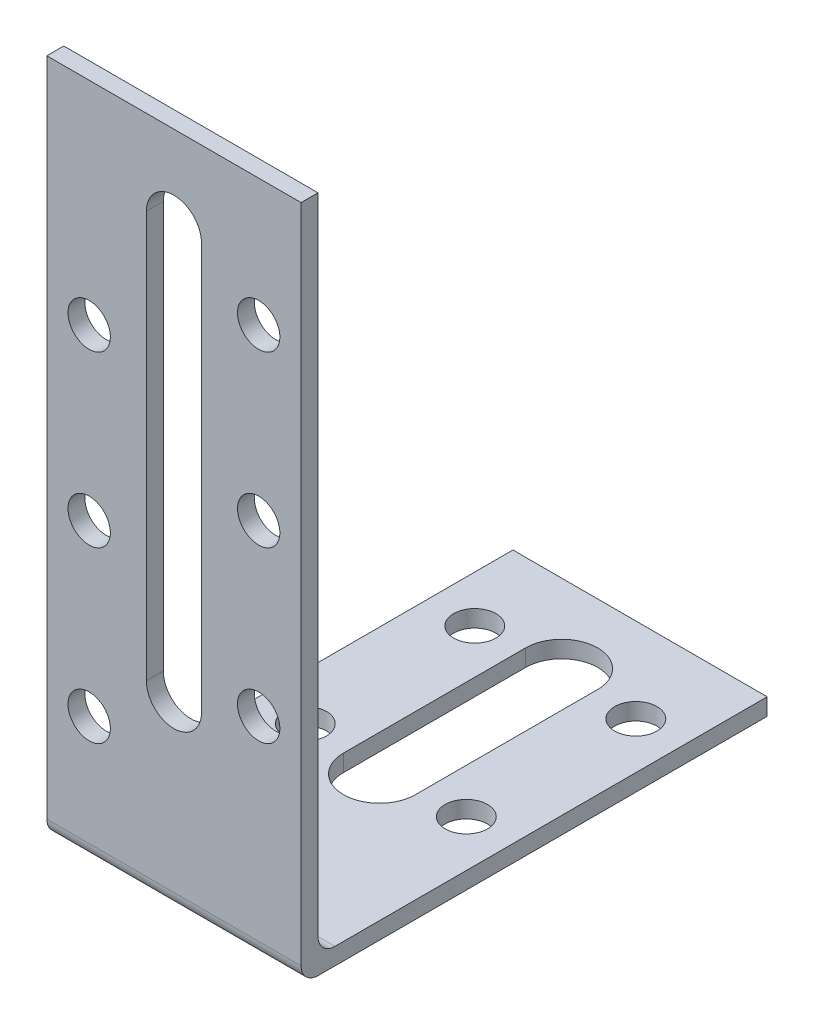
ISO-10303-21;
HEADER;
FILE_DESCRIPTION(('STEP AP214'),'2;1');
FILE_NAME('part.step','',(''),(''),'','','');
FILE_SCHEMA(('AUTOMOTIVE_DESIGN { 1 0 10303 214 1 1 1 1 }'));
ENDSEC;
DATA;
#1=APPLICATION_CONTEXT('core data for automotive mechanical design processes');
#2=APPLICATION_PROTOCOL_DEFINITION('international standard','automotive_design',2000,#1);
#3=PRODUCT_CONTEXT('',#1,'mechanical');
#4=PRODUCT('Part','Part','',(#3));
#5=PRODUCT_RELATED_PRODUCT_CATEGORY('part','',(#4));
#6=PRODUCT_DEFINITION_FORMATION('','',#4);
#7=PRODUCT_DEFINITION_CONTEXT('part definition',#1,'design');
#8=PRODUCT_DEFINITION('design','',#6,#7);
#9=PRODUCT_DEFINITION_SHAPE('','',#8);
#10=(LENGTH_UNIT() NAMED_UNIT(*) SI_UNIT(.MILLI.,.METRE.));
#11=(NAMED_UNIT(*) PLANE_ANGLE_UNIT() SI_UNIT($,.RADIAN.));
#12=(NAMED_UNIT(*) SI_UNIT($,.STERADIAN.) SOLID_ANGLE_UNIT());
#13=UNCERTAINTY_MEASURE_WITH_UNIT(LENGTH_MEASURE(1.E-05),#10,'distance_accuracy_value','');
#14=(GEOMETRIC_REPRESENTATION_CONTEXT(3) GLOBAL_UNCERTAINTY_ASSIGNED_CONTEXT((#13)) GLOBAL_UNIT_ASSIGNED_CONTEXT((#10,
#11,#12)) REPRESENTATION_CONTEXT('',''));
#15=CARTESIAN_POINT('',(0.,0.,0.));
#16=DIRECTION('',(0.,0.,1.));
#17=DIRECTION('',(1.,0.,0.));
#18=AXIS2_PLACEMENT_3D('',#15,#16,#17);
#19=CARTESIAN_POINT('',(15.,0.,-55.));
#20=DIRECTION('',(0.,1.,0.));
#21=DIRECTION('',(0.,0.,1.));
#22=AXIS2_PLACEMENT_3D('',#19,#20,#21);
#23=PLANE('',#22);
#24=CARTESIAN_POINT('',(9.5,0.,-45.));
#25=DIRECTION('',(0.,1.,0.));
#26=DIRECTION('',(0.,0.,1.));
#27=AXIS2_PLACEMENT_3D('',#24,#25,#26);
#28=CIRCLE('',#27,2.5);
#29=CARTESIAN_POINT('',(9.5,0.,-42.5));
#30=VERTEX_POINT('',#29);
#31=EDGE_CURVE('E195',#30,#30,#28,.F.);
#32=ORIENTED_EDGE('',*,*,#31,.F.);
#33=EDGE_LOOP('',(#32));
#34=FACE_BOUND('',#33,.T.);
#35=CARTESIAN_POINT('',(-9.49999999999999,0.,-25.));
#36=DIRECTION('',(0.,1.,0.));
#37=DIRECTION('',(0.,0.,1.));
#38=AXIS2_PLACEMENT_3D('',#35,#36,#37);
#39=CIRCLE('',#38,2.5);
#40=CARTESIAN_POINT('',(-9.49999999999999,0.,-22.5));
#41=VERTEX_POINT('',#40);
#42=EDGE_CURVE('E185',#41,#41,#39,.F.);
#43=ORIENTED_EDGE('',*,*,#42,.F.);
#44=EDGE_LOOP('',(#43));
#45=FACE_BOUND('',#44,.T.);
#46=CARTESIAN_POINT('',(0.,0.,-24.25));
#47=DIRECTION('',(0.,1.,0.));
#48=DIRECTION('',(0.,0.,1.));
#49=AXIS2_PLACEMENT_3D('',#46,#47,#48);
#50=CIRCLE('',#49,4.25);
#51=CARTESIAN_POINT('',(4.25,0.,-24.25));
#52=VERTEX_POINT('',#51);
#53=CARTESIAN_POINT('',(-4.25,0.,-24.25));
#54=VERTEX_POINT('',#53);
#55=EDGE_CURVE('E208',#52,#54,#50,.F.);
#56=ORIENTED_EDGE('',*,*,#55,.F.);
#57=DIRECTION('',(0.,0.,1.));
#58=VECTOR('',#57,1.);
#59=CARTESIAN_POINT('',(4.25,0.,0.));
#60=LINE('',#59,#58);
#61=CARTESIAN_POINT('',(4.25,0.,-45.75));
#62=VERTEX_POINT('',#61);
#63=EDGE_CURVE('E211',#62,#52,#60,.T.);
#64=ORIENTED_EDGE('',*,*,#63,.F.);
#65=CARTESIAN_POINT('',(0.,0.,-45.75));
#66=DIRECTION('',(0.,1.,0.));
#67=DIRECTION('',(0.,0.,1.));
#68=AXIS2_PLACEMENT_3D('',#65,#66,#67);
#69=CIRCLE('',#68,4.25);
#70=CARTESIAN_POINT('',(-4.25,0.,-45.75));
#71=VERTEX_POINT('',#70);
#72=EDGE_CURVE('E228',#71,#62,#69,.F.);
#73=ORIENTED_EDGE('',*,*,#72,.F.);
#74=DIRECTION('',(0.,0.,1.));
#75=VECTOR('',#74,1.);
#76=CARTESIAN_POINT('',(-4.25,0.,0.));
#77=LINE('',#76,#75);
#78=EDGE_CURVE('E189',#71,#54,#77,.T.);
#79=ORIENTED_EDGE('',*,*,#78,.T.);
#80=EDGE_LOOP('',(#56,#64,#73,#79));
#81=FACE_BOUND('',#80,.T.);
#82=DIRECTION('',(0.,0.,-1.));
#83=VECTOR('',#82,1.);
#84=CARTESIAN_POINT('',(15.,0.,-55.));
#85=LINE('',#84,#83);
#86=CARTESIAN_POINT('',(15.,0.,-2.));
#87=VERTEX_POINT('',#86);
#88=CARTESIAN_POINT('',(15.,0.,-55.));
#89=VERTEX_POINT('',#88);
#90=EDGE_CURVE('E238',#87,#89,#85,.T.);
#91=ORIENTED_EDGE('',*,*,#90,.F.);
#92=DIRECTION('',(-1.,0.,0.));
#93=VECTOR('',#92,1.);
#94=CARTESIAN_POINT('',(15.,0.,-2.));
#95=LINE('',#94,#93);
#96=CARTESIAN_POINT('',(-15.,0.,-2.));
#97=VERTEX_POINT('',#96);
#98=EDGE_CURVE('E277',#87,#97,#95,.T.);
#99=ORIENTED_EDGE('',*,*,#98,.T.);
#100=DIRECTION('',(0.,0.,-1.));
#101=VECTOR('',#100,1.);
#102=CARTESIAN_POINT('',(-15.,0.,-55.));
#103=LINE('',#102,#101);
#104=CARTESIAN_POINT('',(-15.,0.,-55.));
#105=VERTEX_POINT('',#104);
#106=EDGE_CURVE('E237',#97,#105,#103,.T.);
#107=ORIENTED_EDGE('',*,*,#106,.T.);
#108=DIRECTION('',(-1.,0.,0.));
#109=VECTOR('',#108,1.);
#110=CARTESIAN_POINT('',(15.,0.,-55.));
#111=LINE('',#110,#109);
#112=EDGE_CURVE('E274',#89,#105,#111,.T.);
#113=ORIENTED_EDGE('',*,*,#112,.F.);
#114=EDGE_LOOP('',(#91,#99,#107,#113));
#115=FACE_BOUND('',#114,.T.);
#116=CARTESIAN_POINT('',(-9.49999999999999,0.,-45.));
#117=DIRECTION('',(0.,1.,0.));
#118=DIRECTION('',(0.,0.,1.));
#119=AXIS2_PLACEMENT_3D('',#116,#117,#118);
#120=CIRCLE('',#119,2.5);
#121=CARTESIAN_POINT('',(-9.49999999999999,0.,-42.5));
#122=VERTEX_POINT('',#121);
#123=EDGE_CURVE('E192',#122,#122,#120,.T.);
#124=ORIENTED_EDGE('',*,*,#123,.T.);
#125=EDGE_LOOP('',(#124));
#126=FACE_BOUND('',#125,.T.);
#127=CARTESIAN_POINT('',(9.5,0.,-25.));
#128=DIRECTION('',(0.,1.,0.));
#129=DIRECTION('',(0.,0.,1.));
#130=AXIS2_PLACEMENT_3D('',#127,#128,#129);
#131=CIRCLE('',#130,2.5);
#132=CARTESIAN_POINT('',(9.5,0.,-22.5));
#133=VERTEX_POINT('',#132);
#134=EDGE_CURVE('E159',#133,#133,#131,.T.);
#135=ORIENTED_EDGE('',*,*,#134,.T.);
#136=EDGE_LOOP('',(#135));
#137=FACE_BOUND('',#136,.T.);
#138=ADVANCED_FACE('F33',(#34,#45,#81,#115,#126,#137),#23,.F.);
#139=CARTESIAN_POINT('',(15.,2.,-2.00000000000001));
#140=DIRECTION('',(0.,-1.,0.));
#141=DIRECTION('',(0.,0.,-1.));
#142=AXIS2_PLACEMENT_3D('',#139,#140,#141);
#143=PLANE('',#142);
#144=CARTESIAN_POINT('',(9.5,2.,-45.));
#145=DIRECTION('',(0.,1.,0.));
#146=DIRECTION('',(0.,0.,1.));
#147=AXIS2_PLACEMENT_3D('',#144,#145,#146);
#148=CIRCLE('',#147,2.5);
#149=CARTESIAN_POINT('',(9.5,2.,-42.5));
#150=VERTEX_POINT('',#149);
#151=EDGE_CURVE('E196',#150,#150,#148,.T.);
#152=ORIENTED_EDGE('',*,*,#151,.F.);
#153=EDGE_LOOP('',(#152));
#154=FACE_BOUND('',#153,.T.);
#155=CARTESIAN_POINT('',(-9.49999999999999,2.,-25.));
#156=DIRECTION('',(0.,1.,0.));
#157=DIRECTION('',(0.,0.,1.));
#158=AXIS2_PLACEMENT_3D('',#155,#156,#157);
#159=CIRCLE('',#158,2.5);
#160=CARTESIAN_POINT('',(-9.49999999999999,2.,-22.5));
#161=VERTEX_POINT('',#160);
#162=EDGE_CURVE('E182',#161,#161,#159,.T.);
#163=ORIENTED_EDGE('',*,*,#162,.F.);
#164=EDGE_LOOP('',(#163));
#165=FACE_BOUND('',#164,.T.);
#166=CARTESIAN_POINT('',(0.,2.,-45.75));
#167=DIRECTION('',(0.,1.,0.));
#168=DIRECTION('',(0.,0.,1.));
#169=AXIS2_PLACEMENT_3D('',#166,#167,#168);
#170=CIRCLE('',#169,4.25);
#171=CARTESIAN_POINT('',(4.25,2.,-45.75));
#172=VERTEX_POINT('',#171);
#173=CARTESIAN_POINT('',(-4.25,2.,-45.75));
#174=VERTEX_POINT('',#173);
#175=EDGE_CURVE('E216',#172,#174,#170,.T.);
#176=ORIENTED_EDGE('',*,*,#175,.F.);
#177=DIRECTION('',(0.,0.,-1.));
#178=VECTOR('',#177,1.);
#179=CARTESIAN_POINT('',(4.25,2.,0.));
#180=LINE('',#179,#178);
#181=CARTESIAN_POINT('',(4.25,2.,-24.25));
#182=VERTEX_POINT('',#181);
#183=EDGE_CURVE('E214',#182,#172,#180,.T.);
#184=ORIENTED_EDGE('',*,*,#183,.F.);
#185=CARTESIAN_POINT('',(0.,2.,-24.25));
#186=DIRECTION('',(0.,1.,0.));
#187=DIRECTION('',(0.,0.,1.));
#188=AXIS2_PLACEMENT_3D('',#185,#186,#187);
#189=CIRCLE('',#188,4.25);
#190=CARTESIAN_POINT('',(-4.25,2.,-24.25));
#191=VERTEX_POINT('',#190);
#192=EDGE_CURVE('E222',#191,#182,#189,.T.);
#193=ORIENTED_EDGE('',*,*,#192,.F.);
#194=DIRECTION('',(0.,0.,-1.));
#195=VECTOR('',#194,1.);
#196=CARTESIAN_POINT('',(-4.25,2.,0.));
#197=LINE('',#196,#195);
#198=EDGE_CURVE('E219',#191,#174,#197,.T.);
#199=ORIENTED_EDGE('',*,*,#198,.T.);
#200=EDGE_LOOP('',(#176,#184,#193,#199));
#201=FACE_BOUND('',#200,.T.);
#202=DIRECTION('',(0.,0.,1.));
#203=VECTOR('',#202,1.);
#204=CARTESIAN_POINT('',(-15.,2.,-2.00000000000001));
#205=LINE('',#204,#203);
#206=CARTESIAN_POINT('',(-15.,2.,-55.));
#207=VERTEX_POINT('',#206);
#208=CARTESIAN_POINT('',(-15.,2.,-4.00000000000001));
#209=VERTEX_POINT('',#208);
#210=EDGE_CURVE('E257',#207,#209,#205,.T.);
#211=ORIENTED_EDGE('',*,*,#210,.T.);
#212=DIRECTION('',(-1.,0.,0.));
#213=VECTOR('',#212,1.);
#214=CARTESIAN_POINT('',(15.,2.,-4.00000000000001));
#215=LINE('',#214,#213);
#216=CARTESIAN_POINT('',(15.,2.,-4.00000000000001));
#217=VERTEX_POINT('',#216);
#218=EDGE_CURVE('E289',#209,#217,#215,.F.);
#219=ORIENTED_EDGE('',*,*,#218,.T.);
#220=DIRECTION('',(0.,0.,1.));
#221=VECTOR('',#220,1.);
#222=CARTESIAN_POINT('',(15.,2.,-2.00000000000001));
#223=LINE('',#222,#221);
#224=CARTESIAN_POINT('',(15.,2.,-55.));
#225=VERTEX_POINT('',#224);
#226=EDGE_CURVE('E243',#225,#217,#223,.T.);
#227=ORIENTED_EDGE('',*,*,#226,.F.);
#228=DIRECTION('',(-1.,0.,0.));
#229=VECTOR('',#228,1.);
#230=CARTESIAN_POINT('',(15.,2.,-55.));
#231=LINE('',#230,#229);
#232=EDGE_CURVE('E271',#225,#207,#231,.T.);
#233=ORIENTED_EDGE('',*,*,#232,.T.);
#234=EDGE_LOOP('',(#211,#219,#227,#233));
#235=FACE_BOUND('',#234,.T.);
#236=CARTESIAN_POINT('',(-9.49999999999999,2.,-45.));
#237=DIRECTION('',(0.,1.,0.));
#238=DIRECTION('',(0.,0.,1.));
#239=AXIS2_PLACEMENT_3D('',#236,#237,#238);
#240=CIRCLE('',#239,2.5);
#241=CARTESIAN_POINT('',(-9.49999999999999,2.,-42.5));
#242=VERTEX_POINT('',#241);
#243=EDGE_CURVE('E186',#242,#242,#240,.F.);
#244=ORIENTED_EDGE('',*,*,#243,.T.);
#245=EDGE_LOOP('',(#244));
#246=FACE_BOUND('',#245,.T.);
#247=CARTESIAN_POINT('',(9.5,2.,-25.));
#248=DIRECTION('',(0.,1.,0.));
#249=DIRECTION('',(0.,0.,1.));
#250=AXIS2_PLACEMENT_3D('',#247,#248,#249);
#251=CIRCLE('',#250,2.5);
#252=CARTESIAN_POINT('',(9.5,2.,-22.5));
#253=VERTEX_POINT('',#252);
#254=EDGE_CURVE('E199',#253,#253,#251,.F.);
#255=ORIENTED_EDGE('',*,*,#254,.T.);
#256=EDGE_LOOP('',(#255));
#257=FACE_BOUND('',#256,.T.);
#258=ADVANCED_FACE('F301',(#154,#165,#201,#235,#246,#257),#143,.F.);
#259=CARTESIAN_POINT('',(15.,2.,-55.));
#260=DIRECTION('',(0.,0.,1.));
#261=DIRECTION('',(1.,0.,0.));
#262=AXIS2_PLACEMENT_3D('',#259,#260,#261);
#263=PLANE('',#262);
#264=DIRECTION('',(0.,1.,0.));
#265=VECTOR('',#264,1.);
#266=CARTESIAN_POINT('',(-15.,2.,-55.));
#267=LINE('',#266,#265);
#268=EDGE_CURVE('E255',#105,#207,#267,.T.);
#269=ORIENTED_EDGE('',*,*,#268,.T.);
#270=ORIENTED_EDGE('',*,*,#232,.F.);
#271=DIRECTION('',(0.,1.,0.));
#272=VECTOR('',#271,1.);
#273=CARTESIAN_POINT('',(15.,2.,-55.));
#274=LINE('',#273,#272);
#275=EDGE_CURVE('E240',#89,#225,#274,.T.);
#276=ORIENTED_EDGE('',*,*,#275,.F.);
#277=ORIENTED_EDGE('',*,*,#112,.T.);
#278=EDGE_LOOP('',(#269,#270,#276,#277));
#279=FACE_BOUND('',#278,.T.);
#280=ADVANCED_FACE('F329',(#279),#263,.F.);
#281=CARTESIAN_POINT('',(15.,80.,-2.));
#282=DIRECTION('',(0.,0.,1.));
#283=DIRECTION('',(0.,-1.,0.));
#284=AXIS2_PLACEMENT_3D('',#281,#282,#283);
#285=PLANE('',#284);
#286=CARTESIAN_POINT('',(-10.,55.,-2.00000000000001));
#287=DIRECTION('',(0.,0.,-1.));
#288=DIRECTION('',(0.,1.,0.));
#289=AXIS2_PLACEMENT_3D('',#286,#287,#288);
#290=CIRCLE('',#289,2.5);
#291=CARTESIAN_POINT('',(-10.,57.5,-2.00000000000001));
#292=VERTEX_POINT('',#291);
#293=EDGE_CURVE('E594',#292,#292,#290,.T.);
#294=ORIENTED_EDGE('',*,*,#293,.F.);
#295=EDGE_LOOP('',(#294));
#296=FACE_BOUND('',#295,.T.);
#297=CARTESIAN_POINT('',(10.,25.,-2.00000000000001));
#298=DIRECTION('',(0.,0.,-1.));
#299=DIRECTION('',(0.,1.,0.));
#300=AXIS2_PLACEMENT_3D('',#297,#298,#299);
#301=CIRCLE('',#300,2.5);
#302=CARTESIAN_POINT('',(10.,27.5,-2.00000000000001));
#303=VERTEX_POINT('',#302);
#304=EDGE_CURVE('E598',#303,#303,#301,.T.);
#305=ORIENTED_EDGE('',*,*,#304,.F.);
#306=EDGE_LOOP('',(#305));
#307=FACE_BOUND('',#306,.T.);
#308=CARTESIAN_POINT('',(10.,45.,-2.00000000000001));
#309=DIRECTION('',(0.,0.,-1.));
#310=DIRECTION('',(0.,1.,0.));
#311=AXIS2_PLACEMENT_3D('',#308,#309,#310);
#312=CIRCLE('',#311,2.5);
#313=CARTESIAN_POINT('',(10.,47.5,-2.00000000000001));
#314=VERTEX_POINT('',#313);
#315=EDGE_CURVE('E614',#314,#314,#312,.T.);
#316=ORIENTED_EDGE('',*,*,#315,.F.);
#317=EDGE_LOOP('',(#316));
#318=FACE_BOUND('',#317,.T.);
#319=CARTESIAN_POINT('',(10.,65.,-2.));
#320=DIRECTION('',(0.,0.,-1.));
#321=DIRECTION('',(0.,1.,0.));
#322=AXIS2_PLACEMENT_3D('',#319,#320,#321);
#323=CIRCLE('',#322,2.5);
#324=CARTESIAN_POINT('',(10.,67.5,-2.));
#325=VERTEX_POINT('',#324);
#326=EDGE_CURVE('E607',#325,#325,#323,.T.);
#327=ORIENTED_EDGE('',*,*,#326,.F.);
#328=EDGE_LOOP('',(#327));
#329=FACE_BOUND('',#328,.T.);
#330=CARTESIAN_POINT('',(-10.,35.,-2.00000000000001));
#331=DIRECTION('',(0.,0.,-1.));
#332=DIRECTION('',(0.,1.,0.));
#333=AXIS2_PLACEMENT_3D('',#330,#331,#332);
#334=CIRCLE('',#333,2.5);
#335=CARTESIAN_POINT('',(-10.,37.5,-2.00000000000001));
#336=VERTEX_POINT('',#335);
#337=EDGE_CURVE('E631',#336,#336,#334,.T.);
#338=ORIENTED_EDGE('',*,*,#337,.F.);
#339=EDGE_LOOP('',(#338));
#340=FACE_BOUND('',#339,.T.);
#341=CARTESIAN_POINT('',(-10.,15.,-2.00000000000001));
#342=DIRECTION('',(0.,0.,-1.));
#343=DIRECTION('',(0.,1.,0.));
#344=AXIS2_PLACEMENT_3D('',#341,#342,#343);
#345=CIRCLE('',#344,2.5);
#346=CARTESIAN_POINT('',(-10.,17.5,-2.00000000000001));
#347=VERTEX_POINT('',#346);
#348=EDGE_CURVE('E632',#347,#347,#345,.T.);
#349=ORIENTED_EDGE('',*,*,#348,.F.);
#350=EDGE_LOOP('',(#349));
#351=FACE_BOUND('',#350,.T.);
#352=DIRECTION('',(0.,-1.,0.));
#353=VECTOR('',#352,1.);
#354=CARTESIAN_POINT('',(3.25,70.,-2.));
#355=LINE('',#354,#353);
#356=CARTESIAN_POINT('',(3.25,70.,-2.));
#357=VERTEX_POINT('',#356);
#358=CARTESIAN_POINT('',(3.24999999999999,22.,-2.00000000000001));
#359=VERTEX_POINT('',#358);
#360=EDGE_CURVE('E167',#357,#359,#355,.T.);
#361=ORIENTED_EDGE('',*,*,#360,.F.);
#362=CARTESIAN_POINT('',(0.,70.,-2.));
#363=DIRECTION('',(0.,0.,-1.));
#364=DIRECTION('',(0.,1.,0.));
#365=AXIS2_PLACEMENT_3D('',#362,#363,#364);
#366=CIRCLE('',#365,3.25);
#367=CARTESIAN_POINT('',(-3.25,70.,-2.));
#368=VERTEX_POINT('',#367);
#369=EDGE_CURVE('E48',#368,#357,#366,.T.);
#370=ORIENTED_EDGE('',*,*,#369,.F.);
#371=DIRECTION('',(0.,1.,0.));
#372=VECTOR('',#371,1.);
#373=CARTESIAN_POINT('',(-3.25,70.,-2.));
#374=LINE('',#373,#372);
#375=CARTESIAN_POINT('',(-3.25000000000001,22.,-2.00000000000001));
#376=VERTEX_POINT('',#375);
#377=EDGE_CURVE('E153',#376,#368,#374,.T.);
#378=ORIENTED_EDGE('',*,*,#377,.F.);
#379=CARTESIAN_POINT('',(0.,22.,-2.00000000000001));
#380=DIRECTION('',(0.,0.,-1.));
#381=DIRECTION('',(0.,1.,0.));
#382=AXIS2_PLACEMENT_3D('',#379,#380,#381);
#383=CIRCLE('',#382,3.25);
#384=EDGE_CURVE('E173',#359,#376,#383,.T.);
#385=ORIENTED_EDGE('',*,*,#384,.F.);
#386=EDGE_LOOP('',(#361,#370,#378,#385));
#387=FACE_BOUND('',#386,.T.);
#388=DIRECTION('',(0.,1.,0.));
#389=VECTOR('',#388,1.);
#390=CARTESIAN_POINT('',(15.,80.,-2.));
#391=LINE('',#390,#389);
#392=CARTESIAN_POINT('',(15.,4.,-2.00000000000001));
#393=VERTEX_POINT('',#392);
#394=CARTESIAN_POINT('',(15.,80.,-2.));
#395=VERTEX_POINT('',#394);
#396=EDGE_CURVE('E246',#393,#395,#391,.T.);
#397=ORIENTED_EDGE('',*,*,#396,.F.);
#398=DIRECTION('',(-1.,0.,0.));
#399=VECTOR('',#398,1.);
#400=CARTESIAN_POINT('',(-15.,4.,-2.00000000000001));
#401=LINE('',#400,#399);
#402=CARTESIAN_POINT('',(-15.,4.,-2.00000000000001));
#403=VERTEX_POINT('',#402);
#404=EDGE_CURVE('E286',#393,#403,#401,.T.);
#405=ORIENTED_EDGE('',*,*,#404,.T.);
#406=DIRECTION('',(0.,1.,0.));
#407=VECTOR('',#406,1.);
#408=CARTESIAN_POINT('',(-15.,80.,-2.));
#409=LINE('',#408,#407);
#410=CARTESIAN_POINT('',(-15.,80.,-2.));
#411=VERTEX_POINT('',#410);
#412=EDGE_CURVE('E260',#403,#411,#409,.T.);
#413=ORIENTED_EDGE('',*,*,#412,.T.);
#414=DIRECTION('',(-1.,0.,0.));
#415=VECTOR('',#414,1.);
#416=CARTESIAN_POINT('',(15.,80.,-2.));
#417=LINE('',#416,#415);
#418=EDGE_CURVE('E268',#395,#411,#417,.T.);
#419=ORIENTED_EDGE('',*,*,#418,.F.);
#420=EDGE_LOOP('',(#397,#405,#413,#419));
#421=FACE_BOUND('',#420,.T.);
#422=ADVANCED_FACE('F311',(#296,#307,#318,#329,#340,#351,#387,#421),#285,.F.);
#423=CARTESIAN_POINT('',(15.,80.,0.));
#424=DIRECTION('',(0.,-1.,0.));
#425=DIRECTION('',(0.,0.,-1.));
#426=AXIS2_PLACEMENT_3D('',#423,#424,#425);
#427=PLANE('',#426);
#428=DIRECTION('',(0.,0.,1.));
#429=VECTOR('',#428,1.);
#430=CARTESIAN_POINT('',(-15.,80.,0.));
#431=LINE('',#430,#429);
#432=CARTESIAN_POINT('',(-15.,80.,0.));
#433=VERTEX_POINT('',#432);
#434=EDGE_CURVE('E262',#411,#433,#431,.T.);
#435=ORIENTED_EDGE('',*,*,#434,.T.);
#436=DIRECTION('',(-1.,0.,0.));
#437=VECTOR('',#436,1.);
#438=CARTESIAN_POINT('',(15.,80.,0.));
#439=LINE('',#438,#437);
#440=CARTESIAN_POINT('',(15.,80.,0.));
#441=VERTEX_POINT('',#440);
#442=EDGE_CURVE('E253',#441,#433,#439,.T.);
#443=ORIENTED_EDGE('',*,*,#442,.F.);
#444=DIRECTION('',(0.,0.,1.));
#445=VECTOR('',#444,1.);
#446=CARTESIAN_POINT('',(15.,80.,0.));
#447=LINE('',#446,#445);
#448=EDGE_CURVE('E248',#395,#441,#447,.T.);
#449=ORIENTED_EDGE('',*,*,#448,.F.);
#450=ORIENTED_EDGE('',*,*,#418,.T.);
#451=EDGE_LOOP('',(#435,#443,#449,#450));
#452=FACE_BOUND('',#451,.T.);
#453=ADVANCED_FACE('F315',(#452),#427,.F.);
#454=CARTESIAN_POINT('',(15.,0.,0.));
#455=DIRECTION('',(0.,0.,-1.));
#456=DIRECTION('',(-1.,0.,0.));
#457=AXIS2_PLACEMENT_3D('',#454,#455,#456);
#458=PLANE('',#457);
#459=CARTESIAN_POINT('',(-10.,55.,0.));
#460=DIRECTION('',(0.,0.,-1.));
#461=DIRECTION('',(-1.,0.,0.));
#462=AXIS2_PLACEMENT_3D('',#459,#460,#461);
#463=CIRCLE('',#462,2.5);
#464=CARTESIAN_POINT('',(-12.5,55.,0.));
#465=VERTEX_POINT('',#464);
#466=EDGE_CURVE('E597',#465,#465,#463,.F.);
#467=ORIENTED_EDGE('',*,*,#466,.F.);
#468=EDGE_LOOP('',(#467));
#469=FACE_BOUND('',#468,.T.);
#470=CARTESIAN_POINT('',(10.,25.,0.));
#471=DIRECTION('',(0.,0.,-1.));
#472=DIRECTION('',(-1.,0.,0.));
#473=AXIS2_PLACEMENT_3D('',#470,#471,#472);
#474=CIRCLE('',#473,2.5);
#475=CARTESIAN_POINT('',(7.5,25.,0.));
#476=VERTEX_POINT('',#475);
#477=EDGE_CURVE('E601',#476,#476,#474,.F.);
#478=ORIENTED_EDGE('',*,*,#477,.F.);
#479=EDGE_LOOP('',(#478));
#480=FACE_BOUND('',#479,.T.);
#481=CARTESIAN_POINT('',(10.,45.,0.));
#482=DIRECTION('',(0.,0.,-1.));
#483=DIRECTION('',(-1.,0.,0.));
#484=AXIS2_PLACEMENT_3D('',#481,#482,#483);
#485=CIRCLE('',#484,2.5);
#486=CARTESIAN_POINT('',(7.5,45.,0.));
#487=VERTEX_POINT('',#486);
#488=EDGE_CURVE('E611',#487,#487,#485,.F.);
#489=ORIENTED_EDGE('',*,*,#488,.F.);
#490=EDGE_LOOP('',(#489));
#491=FACE_BOUND('',#490,.T.);
#492=CARTESIAN_POINT('',(10.,65.,0.));
#493=DIRECTION('',(0.,0.,-1.));
#494=DIRECTION('',(-1.,0.,0.));
#495=AXIS2_PLACEMENT_3D('',#492,#493,#494);
#496=CIRCLE('',#495,2.5);
#497=CARTESIAN_POINT('',(7.5,65.,0.));
#498=VERTEX_POINT('',#497);
#499=EDGE_CURVE('E610',#498,#498,#496,.F.);
#500=ORIENTED_EDGE('',*,*,#499,.F.);
#501=EDGE_LOOP('',(#500));
#502=FACE_BOUND('',#501,.T.);
#503=CARTESIAN_POINT('',(-10.,35.,0.));
#504=DIRECTION('',(0.,0.,-1.));
#505=DIRECTION('',(-1.,0.,0.));
#506=AXIS2_PLACEMENT_3D('',#503,#504,#505);
#507=CIRCLE('',#506,2.5);
#508=CARTESIAN_POINT('',(-12.5,35.,0.));
#509=VERTEX_POINT('',#508);
#510=EDGE_CURVE('E603',#509,#509,#507,.F.);
#511=ORIENTED_EDGE('',*,*,#510,.F.);
#512=EDGE_LOOP('',(#511));
#513=FACE_BOUND('',#512,.T.);
#514=CARTESIAN_POINT('',(-10.,15.,0.));
#515=DIRECTION('',(0.,0.,-1.));
#516=DIRECTION('',(-1.,0.,0.));
#517=AXIS2_PLACEMENT_3D('',#514,#515,#516);
#518=CIRCLE('',#517,2.5);
#519=CARTESIAN_POINT('',(-12.5,15.,0.));
#520=VERTEX_POINT('',#519);
#521=EDGE_CURVE('E629',#520,#520,#518,.F.);
#522=ORIENTED_EDGE('',*,*,#521,.F.);
#523=EDGE_LOOP('',(#522));
#524=FACE_BOUND('',#523,.T.);
#525=DIRECTION('',(0.,-1.,0.));
#526=VECTOR('',#525,1.);
#527=CARTESIAN_POINT('',(-3.25,70.,0.));
#528=LINE('',#527,#526);
#529=CARTESIAN_POINT('',(-3.25,70.,0.));
#530=VERTEX_POINT('',#529);
#531=CARTESIAN_POINT('',(-3.25000000000001,22.,0.));
#532=VERTEX_POINT('',#531);
#533=EDGE_CURVE('E165',#530,#532,#528,.T.);
#534=ORIENTED_EDGE('',*,*,#533,.F.);
#535=CARTESIAN_POINT('',(0.,70.,0.));
#536=DIRECTION('',(0.,0.,-1.));
#537=DIRECTION('',(-1.,0.,0.));
#538=AXIS2_PLACEMENT_3D('',#535,#536,#537);
#539=CIRCLE('',#538,3.25);
#540=CARTESIAN_POINT('',(3.25,70.,0.));
#541=VERTEX_POINT('',#540);
#542=EDGE_CURVE('E147',#541,#530,#539,.F.);
#543=ORIENTED_EDGE('',*,*,#542,.F.);
#544=DIRECTION('',(0.,1.,0.));
#545=VECTOR('',#544,1.);
#546=CARTESIAN_POINT('',(3.25,70.,0.));
#547=LINE('',#546,#545);
#548=CARTESIAN_POINT('',(3.24999999999999,22.,0.));
#549=VERTEX_POINT('',#548);
#550=EDGE_CURVE('E156',#549,#541,#547,.T.);
#551=ORIENTED_EDGE('',*,*,#550,.F.);
#552=CARTESIAN_POINT('',(0.,22.,0.));
#553=DIRECTION('',(0.,0.,-1.));
#554=DIRECTION('',(-1.,0.,0.));
#555=AXIS2_PLACEMENT_3D('',#552,#553,#554);
#556=CIRCLE('',#555,3.25);
#557=EDGE_CURVE('E56',#532,#549,#556,.F.);
#558=ORIENTED_EDGE('',*,*,#557,.F.);
#559=EDGE_LOOP('',(#534,#543,#551,#558));
#560=FACE_BOUND('',#559,.T.);
#561=DIRECTION('',(0.,-1.,0.));
#562=VECTOR('',#561,1.);
#563=CARTESIAN_POINT('',(-15.,0.,0.));
#564=LINE('',#563,#562);
#565=CARTESIAN_POINT('',(-15.,2.,0.));
#566=VERTEX_POINT('',#565);
#567=EDGE_CURVE('E241',#433,#566,#564,.T.);
#568=ORIENTED_EDGE('',*,*,#567,.T.);
#569=DIRECTION('',(-1.,0.,0.));
#570=VECTOR('',#569,1.);
#571=CARTESIAN_POINT('',(15.,2.,0.));
#572=LINE('',#571,#570);
#573=CARTESIAN_POINT('',(15.,2.,0.));
#574=VERTEX_POINT('',#573);
#575=EDGE_CURVE('E282',#566,#574,#572,.F.);
#576=ORIENTED_EDGE('',*,*,#575,.T.);
#577=DIRECTION('',(0.,-1.,0.));
#578=VECTOR('',#577,1.);
#579=CARTESIAN_POINT('',(15.,0.,0.));
#580=LINE('',#579,#578);
#581=EDGE_CURVE('E250',#441,#574,#580,.T.);
#582=ORIENTED_EDGE('',*,*,#581,.F.);
#583=ORIENTED_EDGE('',*,*,#442,.T.);
#584=EDGE_LOOP('',(#568,#576,#582,#583));
#585=FACE_BOUND('',#584,.T.);
#586=ADVANCED_FACE('F162',(#469,#480,#491,#502,#513,#524,#560,#585),#458,.F.);
#587=CARTESIAN_POINT('',(15.,0.,0.));
#588=DIRECTION('',(-1.,0.,0.));
#589=DIRECTION('',(0.,0.,1.));
#590=AXIS2_PLACEMENT_3D('',#587,#588,#589);
#591=PLANE('',#590);
#592=ORIENTED_EDGE('',*,*,#581,.T.);
#593=CARTESIAN_POINT('',(15.,2.,-2.));
#594=DIRECTION('',(-1.,0.,0.));
#595=DIRECTION('',(0.,0.,1.));
#596=AXIS2_PLACEMENT_3D('',#593,#594,#595);
#597=CIRCLE('',#596,2.);
#598=EDGE_CURVE('E284',#574,#87,#597,.F.);
#599=ORIENTED_EDGE('',*,*,#598,.T.);
#600=ORIENTED_EDGE('',*,*,#90,.T.);
#601=ORIENTED_EDGE('',*,*,#275,.T.);
#602=ORIENTED_EDGE('',*,*,#226,.T.);
#603=CARTESIAN_POINT('',(15.,4.,-4.00000000000001));
#604=DIRECTION('',(-1.,0.,0.));
#605=DIRECTION('',(0.,0.,1.));
#606=AXIS2_PLACEMENT_3D('',#603,#604,#605);
#607=CIRCLE('',#606,2.);
#608=EDGE_CURVE('E11',#217,#393,#607,.T.);
#609=ORIENTED_EDGE('',*,*,#608,.T.);
#610=ORIENTED_EDGE('',*,*,#396,.T.);
#611=ORIENTED_EDGE('',*,*,#448,.T.);
#612=EDGE_LOOP('',(#592,#599,#600,#601,#602,#609,#610,#611));
#613=FACE_BOUND('',#612,.T.);
#614=ADVANCED_FACE('F308',(#613),#591,.F.);
#615=CARTESIAN_POINT('',(-15.,0.,0.));
#616=DIRECTION('',(-1.,0.,0.));
#617=DIRECTION('',(0.,0.,1.));
#618=AXIS2_PLACEMENT_3D('',#615,#616,#617);
#619=PLANE('',#618);
#620=ORIENTED_EDGE('',*,*,#106,.F.);
#621=CARTESIAN_POINT('',(-15.,2.,-2.));
#622=DIRECTION('',(-1.,0.,0.));
#623=DIRECTION('',(0.,0.,1.));
#624=AXIS2_PLACEMENT_3D('',#621,#622,#623);
#625=CIRCLE('',#624,2.);
#626=EDGE_CURVE('E280',#97,#566,#625,.T.);
#627=ORIENTED_EDGE('',*,*,#626,.T.);
#628=ORIENTED_EDGE('',*,*,#567,.F.);
#629=ORIENTED_EDGE('',*,*,#434,.F.);
#630=ORIENTED_EDGE('',*,*,#412,.F.);
#631=CARTESIAN_POINT('',(-15.,4.,-4.00000000000001));
#632=DIRECTION('',(-1.,0.,0.));
#633=DIRECTION('',(0.,0.,1.));
#634=AXIS2_PLACEMENT_3D('',#631,#632,#633);
#635=CIRCLE('',#634,2.);
#636=EDGE_CURVE('E41',#403,#209,#635,.F.);
#637=ORIENTED_EDGE('',*,*,#636,.T.);
#638=ORIENTED_EDGE('',*,*,#210,.F.);
#639=ORIENTED_EDGE('',*,*,#268,.F.);
#640=EDGE_LOOP('',(#620,#627,#628,#629,#630,#637,#638,#639));
#641=FACE_BOUND('',#640,.T.);
#642=ADVANCED_FACE('F294',(#641),#619,.T.);
#643=CARTESIAN_POINT('',(15.,2.,-2.));
#644=DIRECTION('',(-1.,0.,0.));
#645=DIRECTION('',(0.,0.,1.));
#646=AXIS2_PLACEMENT_3D('',#643,#644,#645);
#647=CYLINDRICAL_SURFACE('',#646,2.);
#648=ORIENTED_EDGE('',*,*,#598,.F.);
#649=ORIENTED_EDGE('',*,*,#575,.F.);
#650=ORIENTED_EDGE('',*,*,#626,.F.);
#651=ORIENTED_EDGE('',*,*,#98,.F.);
#652=EDGE_LOOP('',(#648,#649,#650,#651));
#653=FACE_BOUND('',#652,.T.);
#654=ADVANCED_FACE('F322',(#653),#647,.T.);
#655=CARTESIAN_POINT('',(15.,4.,-4.00000000000001));
#656=DIRECTION('',(1.,0.,0.));
#657=DIRECTION('',(0.,0.,-1.));
#658=AXIS2_PLACEMENT_3D('',#655,#656,#657);
#659=CYLINDRICAL_SURFACE('',#658,2.);
#660=ORIENTED_EDGE('',*,*,#608,.F.);
#661=ORIENTED_EDGE('',*,*,#218,.F.);
#662=ORIENTED_EDGE('',*,*,#636,.F.);
#663=ORIENTED_EDGE('',*,*,#404,.F.);
#664=EDGE_LOOP('',(#660,#661,#662,#663));
#665=FACE_BOUND('',#664,.T.);
#666=ADVANCED_FACE('F35',(#665),#659,.F.);
#667=CARTESIAN_POINT('',(4.25,-0.00100000000000317,0.));
#668=DIRECTION('',(1.,0.,0.));
#669=DIRECTION('',(0.,0.,-1.));
#670=AXIS2_PLACEMENT_3D('',#667,#668,#669);
#671=PLANE('',#670);
#672=ORIENTED_EDGE('',*,*,#63,.T.);
#673=DIRECTION('',(0.,1.,0.));
#674=VECTOR('',#673,1.);
#675=CARTESIAN_POINT('',(4.25,-0.00100000000000187,-24.25));
#676=LINE('',#675,#674);
#677=EDGE_CURVE('E226',#52,#182,#676,.T.);
#678=ORIENTED_EDGE('',*,*,#677,.T.);
#679=ORIENTED_EDGE('',*,*,#183,.T.);
#680=DIRECTION('',(0.,1.,0.));
#681=VECTOR('',#680,1.);
#682=CARTESIAN_POINT('',(4.25,-0.00100000000000057,-45.75));
#683=LINE('',#682,#681);
#684=EDGE_CURVE('E225',#62,#172,#683,.T.);
#685=ORIENTED_EDGE('',*,*,#684,.F.);
#686=EDGE_LOOP('',(#672,#678,#679,#685));
#687=FACE_BOUND('',#686,.T.);
#688=ADVANCED_FACE('F352',(#687),#671,.F.);
#689=CARTESIAN_POINT('',(0.,-0.00100000000000187,-24.25));
#690=DIRECTION('',(0.,1.,0.));
#691=DIRECTION('',(0.,0.,1.));
#692=AXIS2_PLACEMENT_3D('',#689,#690,#691);
#693=CYLINDRICAL_SURFACE('',#692,4.25);
#694=ORIENTED_EDGE('',*,*,#55,.T.);
#695=DIRECTION('',(0.,1.,0.));
#696=VECTOR('',#695,1.);
#697=CARTESIAN_POINT('',(-4.25,-0.00100000000000187,-24.25));
#698=LINE('',#697,#696);
#699=EDGE_CURVE('E229',#54,#191,#698,.T.);
#700=ORIENTED_EDGE('',*,*,#699,.T.);
#701=ORIENTED_EDGE('',*,*,#192,.T.);
#702=ORIENTED_EDGE('',*,*,#677,.F.);
#703=EDGE_LOOP('',(#694,#700,#701,#702));
#704=FACE_BOUND('',#703,.T.);
#705=ADVANCED_FACE('F410',(#704),#693,.F.);
#706=CARTESIAN_POINT('',(-4.25,-0.00100000000000317,0.));
#707=DIRECTION('',(1.,0.,0.));
#708=DIRECTION('',(0.,0.,-1.));
#709=AXIS2_PLACEMENT_3D('',#706,#707,#708);
#710=PLANE('',#709);
#711=DIRECTION('',(0.,1.,0.));
#712=VECTOR('',#711,1.);
#713=CARTESIAN_POINT('',(-4.25,-0.00100000000000057,-45.75));
#714=LINE('',#713,#712);
#715=EDGE_CURVE('E231',#71,#174,#714,.T.);
#716=ORIENTED_EDGE('',*,*,#715,.T.);
#717=ORIENTED_EDGE('',*,*,#198,.F.);
#718=ORIENTED_EDGE('',*,*,#699,.F.);
#719=ORIENTED_EDGE('',*,*,#78,.F.);
#720=EDGE_LOOP('',(#716,#717,#718,#719));
#721=FACE_BOUND('',#720,.T.);
#722=ADVANCED_FACE('F419',(#721),#710,.T.);
#723=CARTESIAN_POINT('',(0.,-0.00100000000000057,-45.75));
#724=DIRECTION('',(0.,1.,0.));
#725=DIRECTION('',(0.,0.,1.));
#726=AXIS2_PLACEMENT_3D('',#723,#724,#725);
#727=CYLINDRICAL_SURFACE('',#726,4.25);
#728=ORIENTED_EDGE('',*,*,#72,.T.);
#729=ORIENTED_EDGE('',*,*,#684,.T.);
#730=ORIENTED_EDGE('',*,*,#175,.T.);
#731=ORIENTED_EDGE('',*,*,#715,.F.);
#732=EDGE_LOOP('',(#728,#729,#730,#731));
#733=FACE_BOUND('',#732,.T.);
#734=ADVANCED_FACE('F429',(#733),#727,.F.);
#735=CARTESIAN_POINT('',(-9.49999999999999,-0.00100000000000187,-25.));
#736=DIRECTION('',(0.,1.,0.));
#737=DIRECTION('',(0.,0.,1.));
#738=AXIS2_PLACEMENT_3D('',#735,#736,#737);
#739=CYLINDRICAL_SURFACE('',#738,2.5);
#740=ORIENTED_EDGE('',*,*,#162,.T.);
#741=EDGE_LOOP('',(#740));
#742=FACE_BOUND('',#741,.T.);
#743=ORIENTED_EDGE('',*,*,#42,.T.);
#744=EDGE_LOOP('',(#743));
#745=FACE_BOUND('',#744,.T.);
#746=ADVANCED_FACE('F439',(#742,#745),#739,.F.);
#747=CARTESIAN_POINT('',(-9.49999999999999,-0.00100000000000057,-45.));
#748=DIRECTION('',(0.,1.,0.));
#749=DIRECTION('',(0.,0.,1.));
#750=AXIS2_PLACEMENT_3D('',#747,#748,#749);
#751=CYLINDRICAL_SURFACE('',#750,2.5);
#752=ORIENTED_EDGE('',*,*,#243,.F.);
#753=EDGE_LOOP('',(#752));
#754=FACE_BOUND('',#753,.T.);
#755=ORIENTED_EDGE('',*,*,#123,.F.);
#756=EDGE_LOOP('',(#755));
#757=FACE_BOUND('',#756,.T.);
#758=ADVANCED_FACE('F449',(#754,#757),#751,.F.);
#759=CARTESIAN_POINT('',(9.5,-0.00100000000000057,-45.));
#760=DIRECTION('',(0.,1.,0.));
#761=DIRECTION('',(0.,0.,1.));
#762=AXIS2_PLACEMENT_3D('',#759,#760,#761);
#763=CYLINDRICAL_SURFACE('',#762,2.5);
#764=ORIENTED_EDGE('',*,*,#151,.T.);
#765=EDGE_LOOP('',(#764));
#766=FACE_BOUND('',#765,.T.);
#767=ORIENTED_EDGE('',*,*,#31,.T.);
#768=EDGE_LOOP('',(#767));
#769=FACE_BOUND('',#768,.T.);
#770=ADVANCED_FACE('F459',(#766,#769),#763,.F.);
#771=CARTESIAN_POINT('',(9.5,-0.00100000000000187,-25.));
#772=DIRECTION('',(0.,1.,0.));
#773=DIRECTION('',(0.,0.,1.));
#774=AXIS2_PLACEMENT_3D('',#771,#772,#773);
#775=CYLINDRICAL_SURFACE('',#774,2.5);
#776=ORIENTED_EDGE('',*,*,#254,.F.);
#777=EDGE_LOOP('',(#776));
#778=FACE_BOUND('',#777,.T.);
#779=ORIENTED_EDGE('',*,*,#134,.F.);
#780=EDGE_LOOP('',(#779));
#781=FACE_BOUND('',#780,.T.);
#782=ADVANCED_FACE('F470',(#778,#781),#775,.F.);
#783=CARTESIAN_POINT('',(0.,70.,0.00100000000000837));
#784=DIRECTION('',(0.,0.,-1.));
#785=DIRECTION('',(0.,1.,0.));
#786=AXIS2_PLACEMENT_3D('',#783,#784,#785);
#787=CYLINDRICAL_SURFACE('',#786,3.25);
#788=ORIENTED_EDGE('',*,*,#542,.T.);
#789=DIRECTION('',(0.,0.,-1.));
#790=VECTOR('',#789,1.);
#791=CARTESIAN_POINT('',(-3.25,70.,0.00100000000000837));
#792=LINE('',#791,#790);
#793=EDGE_CURVE('E160',#530,#368,#792,.T.);
#794=ORIENTED_EDGE('',*,*,#793,.T.);
#795=ORIENTED_EDGE('',*,*,#369,.T.);
#796=DIRECTION('',(0.,0.,-1.));
#797=VECTOR('',#796,1.);
#798=CARTESIAN_POINT('',(3.25,70.,0.00100000000000837));
#799=LINE('',#798,#797);
#800=EDGE_CURVE('E143',#541,#357,#799,.T.);
#801=ORIENTED_EDGE('',*,*,#800,.F.);
#802=EDGE_LOOP('',(#788,#794,#795,#801));
#803=FACE_BOUND('',#802,.T.);
#804=ADVANCED_FACE('F145',(#803),#787,.F.);
#805=CARTESIAN_POINT('',(-3.25,70.,0.00100000000000837));
#806=DIRECTION('',(-1.,0.,0.));
#807=DIRECTION('',(0.,-1.,0.));
#808=AXIS2_PLACEMENT_3D('',#805,#806,#807);
#809=PLANE('',#808);
#810=ORIENTED_EDGE('',*,*,#533,.T.);
#811=DIRECTION('',(0.,0.,-1.));
#812=VECTOR('',#811,1.);
#813=CARTESIAN_POINT('',(-3.25000000000001,22.,0.00100000000000273));
#814=LINE('',#813,#812);
#815=EDGE_CURVE('E179',#532,#376,#814,.T.);
#816=ORIENTED_EDGE('',*,*,#815,.T.);
#817=ORIENTED_EDGE('',*,*,#377,.T.);
#818=ORIENTED_EDGE('',*,*,#793,.F.);
#819=EDGE_LOOP('',(#810,#816,#817,#818));
#820=FACE_BOUND('',#819,.T.);
#821=ADVANCED_FACE('F501',(#820),#809,.F.);
#822=CARTESIAN_POINT('',(0.,22.,0.00100000000000273));
#823=DIRECTION('',(0.,0.,-1.));
#824=DIRECTION('',(0.,1.,0.));
#825=AXIS2_PLACEMENT_3D('',#822,#823,#824);
#826=CYLINDRICAL_SURFACE('',#825,3.25);
#827=ORIENTED_EDGE('',*,*,#557,.T.);
#828=DIRECTION('',(0.,0.,-1.));
#829=VECTOR('',#828,1.);
#830=CARTESIAN_POINT('',(3.24999999999999,22.,0.00100000000000273));
#831=LINE('',#830,#829);
#832=EDGE_CURVE('E152',#549,#359,#831,.T.);
#833=ORIENTED_EDGE('',*,*,#832,.T.);
#834=ORIENTED_EDGE('',*,*,#384,.T.);
#835=ORIENTED_EDGE('',*,*,#815,.F.);
#836=EDGE_LOOP('',(#827,#833,#834,#835));
#837=FACE_BOUND('',#836,.T.);
#838=ADVANCED_FACE('F507',(#837),#826,.F.);
#839=CARTESIAN_POINT('',(3.25,70.,0.00100000000000837));
#840=DIRECTION('',(1.,0.,0.));
#841=DIRECTION('',(0.,1.,0.));
#842=AXIS2_PLACEMENT_3D('',#839,#840,#841);
#843=PLANE('',#842);
#844=ORIENTED_EDGE('',*,*,#550,.T.);
#845=ORIENTED_EDGE('',*,*,#800,.T.);
#846=ORIENTED_EDGE('',*,*,#360,.T.);
#847=ORIENTED_EDGE('',*,*,#832,.F.);
#848=EDGE_LOOP('',(#844,#845,#846,#847));
#849=FACE_BOUND('',#848,.T.);
#850=ADVANCED_FACE('F157',(#849),#843,.F.);
#851=CARTESIAN_POINT('',(-10.,15.,0.00100000000000187));
#852=DIRECTION('',(0.,0.,-1.));
#853=DIRECTION('',(0.,1.,0.));
#854=AXIS2_PLACEMENT_3D('',#851,#852,#853);
#855=CYLINDRICAL_SURFACE('',#854,2.5);
#856=ORIENTED_EDGE('',*,*,#348,.T.);
#857=EDGE_LOOP('',(#856));
#858=FACE_BOUND('',#857,.T.);
#859=ORIENTED_EDGE('',*,*,#521,.T.);
#860=EDGE_LOOP('',(#859));
#861=FACE_BOUND('',#860,.T.);
#862=ADVANCED_FACE('F521',(#858,#861),#855,.F.);
#863=CARTESIAN_POINT('',(-10.,35.,0.00100000000000447));
#864=DIRECTION('',(0.,0.,-1.));
#865=DIRECTION('',(0.,1.,0.));
#866=AXIS2_PLACEMENT_3D('',#863,#864,#865);
#867=CYLINDRICAL_SURFACE('',#866,2.5);
#868=ORIENTED_EDGE('',*,*,#337,.T.);
#869=EDGE_LOOP('',(#868));
#870=FACE_BOUND('',#869,.T.);
#871=ORIENTED_EDGE('',*,*,#510,.T.);
#872=EDGE_LOOP('',(#871));
#873=FACE_BOUND('',#872,.T.);
#874=ADVANCED_FACE('F528',(#870,#873),#867,.F.);
#875=CARTESIAN_POINT('',(10.,65.,0.00100000000000794));
#876=DIRECTION('',(0.,0.,-1.));
#877=DIRECTION('',(0.,1.,0.));
#878=AXIS2_PLACEMENT_3D('',#875,#876,#877);
#879=CYLINDRICAL_SURFACE('',#878,2.5);
#880=ORIENTED_EDGE('',*,*,#326,.T.);
#881=EDGE_LOOP('',(#880));
#882=FACE_BOUND('',#881,.T.);
#883=ORIENTED_EDGE('',*,*,#499,.T.);
#884=EDGE_LOOP('',(#883));
#885=FACE_BOUND('',#884,.T.);
#886=ADVANCED_FACE('F536',(#882,#885),#879,.F.);
#887=CARTESIAN_POINT('',(10.,45.,0.00100000000000534));
#888=DIRECTION('',(0.,0.,-1.));
#889=DIRECTION('',(0.,1.,0.));
#890=AXIS2_PLACEMENT_3D('',#887,#888,#889);
#891=CYLINDRICAL_SURFACE('',#890,2.5);
#892=ORIENTED_EDGE('',*,*,#315,.T.);
#893=EDGE_LOOP('',(#892));
#894=FACE_BOUND('',#893,.T.);
#895=ORIENTED_EDGE('',*,*,#488,.T.);
#896=EDGE_LOOP('',(#895));
#897=FACE_BOUND('',#896,.T.);
#898=ADVANCED_FACE('F544',(#894,#897),#891,.F.);
#899=CARTESIAN_POINT('',(10.,25.,0.00100000000000317));
#900=DIRECTION('',(0.,0.,-1.));
#901=DIRECTION('',(0.,1.,0.));
#902=AXIS2_PLACEMENT_3D('',#899,#900,#901);
#903=CYLINDRICAL_SURFACE('',#902,2.5);
#904=ORIENTED_EDGE('',*,*,#304,.T.);
#905=EDGE_LOOP('',(#904));
#906=FACE_BOUND('',#905,.T.);
#907=ORIENTED_EDGE('',*,*,#477,.T.);
#908=EDGE_LOOP('',(#907));
#909=FACE_BOUND('',#908,.T.);
#910=ADVANCED_FACE('F552',(#906,#909),#903,.F.);
#911=CARTESIAN_POINT('',(-10.,55.,0.00100000000000664));
#912=DIRECTION('',(0.,0.,-1.));
#913=DIRECTION('',(0.,1.,0.));
#914=AXIS2_PLACEMENT_3D('',#911,#912,#913);
#915=CYLINDRICAL_SURFACE('',#914,2.5);
#916=ORIENTED_EDGE('',*,*,#293,.T.);
#917=EDGE_LOOP('',(#916));
#918=FACE_BOUND('',#917,.T.);
#919=ORIENTED_EDGE('',*,*,#466,.T.);
#920=EDGE_LOOP('',(#919));
#921=FACE_BOUND('',#920,.T.);
#922=ADVANCED_FACE('F560',(#918,#921),#915,.F.);
#923=CLOSED_SHELL('',(#138,#258,#280,#422,#453,#586,#614,#642,#654,#666,#688,#705,#722,#734,
#746,#758,#770,#782,#804,#821,#838,#850,#862,#874,#886,#898,#910,#922));
#924=MANIFOLD_SOLID_BREP('B2',#923);
#925=ADVANCED_BREP_SHAPE_REPRESENTATION('',(#18,#924),#14);
#926=SHAPE_DEFINITION_REPRESENTATION(#9,#925);
ENDSEC;
END-ISO-10303-21;
